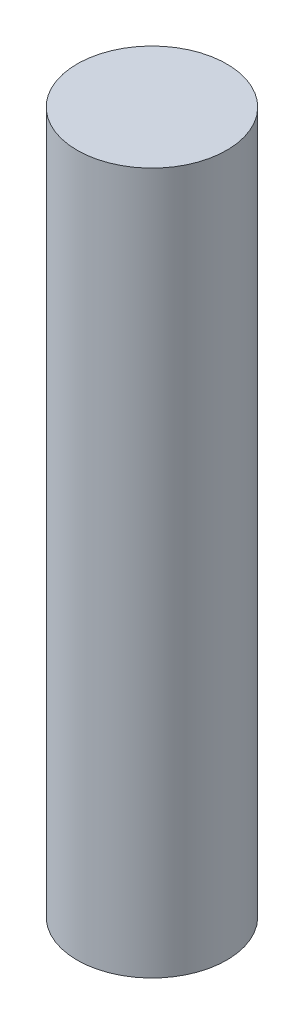
ISO-10303-21;
HEADER;
FILE_DESCRIPTION(('STEP AP214'),'2;1');
FILE_NAME('part.step','',(''),(''),'','','');
FILE_SCHEMA(('AUTOMOTIVE_DESIGN { 1 0 10303 214 1 1 1 1 }'));
ENDSEC;
DATA;
#1=APPLICATION_CONTEXT('core data for automotive mechanical design processes');
#2=APPLICATION_PROTOCOL_DEFINITION('international standard','automotive_design',2000,#1);
#3=PRODUCT_CONTEXT('',#1,'mechanical');
#4=PRODUCT('Part','Part','',(#3));
#5=PRODUCT_RELATED_PRODUCT_CATEGORY('part','',(#4));
#6=PRODUCT_DEFINITION_FORMATION('','',#4);
#7=PRODUCT_DEFINITION_CONTEXT('part definition',#1,'design');
#8=PRODUCT_DEFINITION('design','',#6,#7);
#9=PRODUCT_DEFINITION_SHAPE('','',#8);
#10=(LENGTH_UNIT() NAMED_UNIT(*) SI_UNIT(.MILLI.,.METRE.));
#11=(NAMED_UNIT(*) PLANE_ANGLE_UNIT() SI_UNIT($,.RADIAN.));
#12=(NAMED_UNIT(*) SI_UNIT($,.STERADIAN.) SOLID_ANGLE_UNIT());
#13=UNCERTAINTY_MEASURE_WITH_UNIT(LENGTH_MEASURE(1.E-05),#10,'distance_accuracy_value','');
#14=(GEOMETRIC_REPRESENTATION_CONTEXT(3) GLOBAL_UNCERTAINTY_ASSIGNED_CONTEXT((#13)) GLOBAL_UNIT_ASSIGNED_CONTEXT((#10,
#11,#12)) REPRESENTATION_CONTEXT('',''));
#15=CARTESIAN_POINT('',(0.,0.,0.));
#16=DIRECTION('',(0.,0.,1.));
#17=DIRECTION('',(1.,0.,0.));
#18=AXIS2_PLACEMENT_3D('',#15,#16,#17);
#19=CARTESIAN_POINT('',(0.,15.,0.));
#20=DIRECTION('',(0.,-1.,0.));
#21=DIRECTION('',(0.,0.,-1.));
#22=AXIS2_PLACEMENT_3D('',#19,#20,#21);
#23=CYLINDRICAL_SURFACE('',#22,1.6);
#24=CARTESIAN_POINT('',(0.,15.,0.));
#25=DIRECTION('',(0.,1.,0.));
#26=DIRECTION('',(0.,0.,1.));
#27=AXIS2_PLACEMENT_3D('',#24,#25,#26);
#28=CIRCLE('',#27,1.6);
#29=CARTESIAN_POINT('',(0.,15.,1.6));
#30=VERTEX_POINT('',#29);
#31=EDGE_CURVE('E10',#30,#30,#28,.T.);
#32=ORIENTED_EDGE('',*,*,#31,.F.);
#33=EDGE_LOOP('',(#32));
#34=FACE_BOUND('',#33,.T.);
#35=CARTESIAN_POINT('',(0.,0.,0.));
#36=DIRECTION('',(0.,1.,0.));
#37=DIRECTION('',(0.,0.,1.));
#38=AXIS2_PLACEMENT_3D('',#35,#36,#37);
#39=CIRCLE('',#38,1.6);
#40=CARTESIAN_POINT('',(0.,0.,1.6));
#41=VERTEX_POINT('',#40);
#42=EDGE_CURVE('E34',#41,#41,#39,.T.);
#43=ORIENTED_EDGE('',*,*,#42,.T.);
#44=EDGE_LOOP('',(#43));
#45=FACE_BOUND('',#44,.T.);
#46=ADVANCED_FACE('F31',(#34,#45),#23,.T.);
#47=CARTESIAN_POINT('',(0.,15.,0.));
#48=DIRECTION('',(0.,1.,0.));
#49=DIRECTION('',(0.,0.,1.));
#50=AXIS2_PLACEMENT_3D('',#47,#48,#49);
#51=PLANE('',#50);
#52=ORIENTED_EDGE('',*,*,#31,.T.);
#53=EDGE_LOOP('',(#52));
#54=FACE_BOUND('',#53,.T.);
#55=ADVANCED_FACE('F46',(#54),#51,.T.);
#56=CARTESIAN_POINT('',(0.,0.,0.));
#57=DIRECTION('',(0.,1.,0.));
#58=DIRECTION('',(0.,0.,1.));
#59=AXIS2_PLACEMENT_3D('',#56,#57,#58);
#60=PLANE('',#59);
#61=ORIENTED_EDGE('',*,*,#42,.F.);
#62=EDGE_LOOP('',(#61));
#63=FACE_BOUND('',#62,.T.);
#64=ADVANCED_FACE('F44',(#63),#60,.F.);
#65=CLOSED_SHELL('',(#46,#55,#64));
#66=MANIFOLD_SOLID_BREP('B2',#65);
#67=ADVANCED_BREP_SHAPE_REPRESENTATION('',(#18,#66),#14);
#68=SHAPE_DEFINITION_REPRESENTATION(#9,#67);
ENDSEC;
END-ISO-10303-21;
